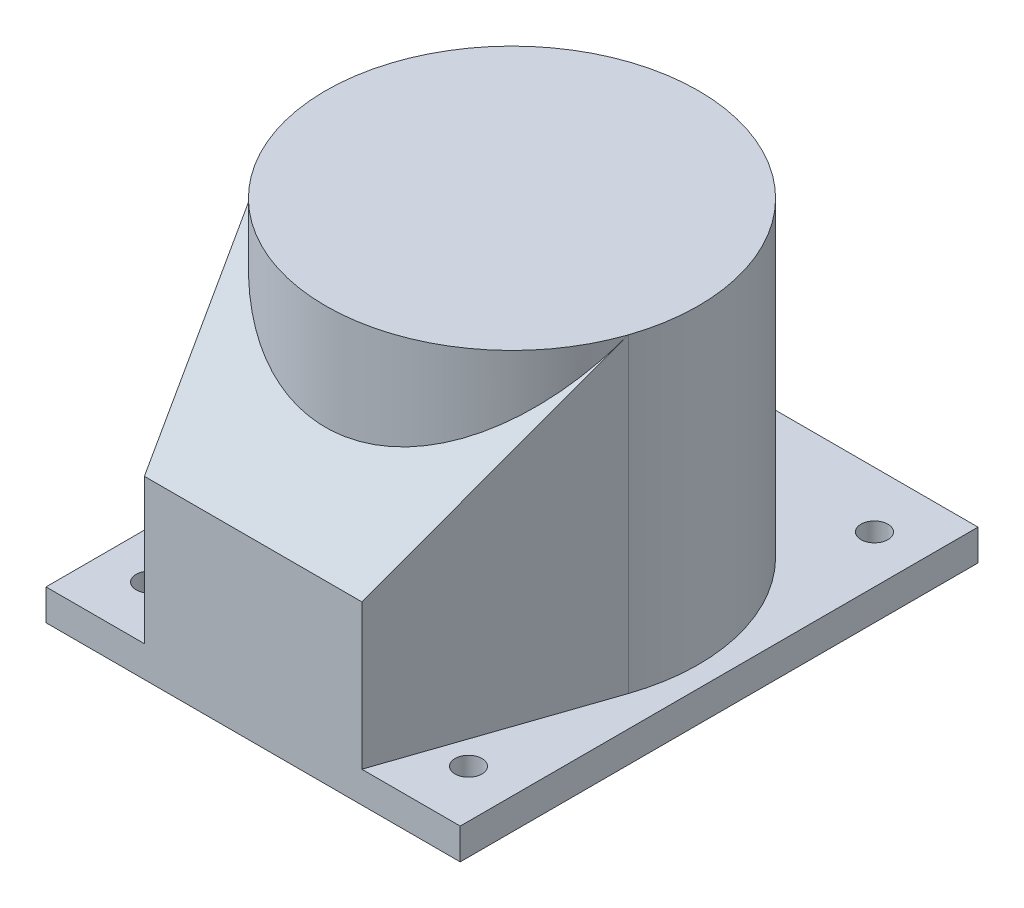
ISO-10303-21;
HEADER;
FILE_DESCRIPTION(('STEP AP214'),'2;1');
FILE_NAME('part.step','',(''),(''),'','','');
FILE_SCHEMA(('AUTOMOTIVE_DESIGN { 1 0 10303 214 1 1 1 1 }'));
ENDSEC;
DATA;
#1=APPLICATION_CONTEXT('core data for automotive mechanical design processes');
#2=APPLICATION_PROTOCOL_DEFINITION('international standard','automotive_design',2000,#1);
#3=PRODUCT_CONTEXT('',#1,'mechanical');
#4=PRODUCT('Part','Part','',(#3));
#5=PRODUCT_RELATED_PRODUCT_CATEGORY('part','',(#4));
#6=PRODUCT_DEFINITION_FORMATION('','',#4);
#7=PRODUCT_DEFINITION_CONTEXT('part definition',#1,'design');
#8=PRODUCT_DEFINITION('design','',#6,#7);
#9=PRODUCT_DEFINITION_SHAPE('','',#8);
#10=(LENGTH_UNIT() NAMED_UNIT(*) SI_UNIT(.MILLI.,.METRE.));
#11=(NAMED_UNIT(*) PLANE_ANGLE_UNIT() SI_UNIT($,.RADIAN.));
#12=(NAMED_UNIT(*) SI_UNIT($,.STERADIAN.) SOLID_ANGLE_UNIT());
#13=UNCERTAINTY_MEASURE_WITH_UNIT(LENGTH_MEASURE(1.E-05),#10,'distance_accuracy_value','');
#14=(GEOMETRIC_REPRESENTATION_CONTEXT(3) GLOBAL_UNCERTAINTY_ASSIGNED_CONTEXT((#13)) GLOBAL_UNIT_ASSIGNED_CONTEXT((#10,
#11,#12)) REPRESENTATION_CONTEXT('',''));
#15=CARTESIAN_POINT('',(0.,0.,0.));
#16=DIRECTION('',(0.,0.,1.));
#17=DIRECTION('',(1.,0.,0.));
#18=AXIS2_PLACEMENT_3D('',#15,#16,#17);
#19=CARTESIAN_POINT('',(99.9999999999996,15.,125.));
#20=DIRECTION('',(0.,0.,-1.));
#21=DIRECTION('',(-1.,0.,0.));
#22=AXIS2_PLACEMENT_3D('',#19,#20,#21);
#23=PLANE('',#22);
#24=DIRECTION('',(1.,0.,0.));
#25=VECTOR('',#24,1.);
#26=CARTESIAN_POINT('',(-515.841961586301,85.,124.999999999998));
#27=LINE('',#26,#25);
#28=CARTESIAN_POINT('',(-52.5000000000006,85.,125.));
#29=VERTEX_POINT('',#28);
#30=CARTESIAN_POINT('',(52.4999999999994,85.,125.));
#31=VERTEX_POINT('',#30);
#32=EDGE_CURVE('E106',#29,#31,#27,.T.);
#33=ORIENTED_EDGE('',*,*,#32,.F.);
#34=DIRECTION('',(0.,-1.,0.));
#35=VECTOR('',#34,1.);
#36=CARTESIAN_POINT('',(-52.5000000000004,165.,125.));
#37=LINE('',#36,#35);
#38=CARTESIAN_POINT('',(-52.5000000000004,15.,125.));
#39=VERTEX_POINT('',#38);
#40=EDGE_CURVE('E122',#29,#39,#37,.T.);
#41=ORIENTED_EDGE('',*,*,#40,.T.);
#42=DIRECTION('',(1.,0.,0.));
#43=VECTOR('',#42,1.);
#44=CARTESIAN_POINT('',(99.9999999999996,15.,125.));
#45=LINE('',#44,#43);
#46=CARTESIAN_POINT('',(-100.,15.,125.));
#47=VERTEX_POINT('',#46);
#48=EDGE_CURVE('E171',#47,#39,#45,.T.);
#49=ORIENTED_EDGE('',*,*,#48,.F.);
#50=DIRECTION('',(0.,-1.,0.));
#51=VECTOR('',#50,1.);
#52=CARTESIAN_POINT('',(-100.,15.,125.));
#53=LINE('',#52,#51);
#54=CARTESIAN_POINT('',(-100.,0.,125.));
#55=VERTEX_POINT('',#54);
#56=EDGE_CURVE('E40',#47,#55,#53,.T.);
#57=ORIENTED_EDGE('',*,*,#56,.T.);
#58=DIRECTION('',(1.,0.,0.));
#59=VECTOR('',#58,1.);
#60=CARTESIAN_POINT('',(99.9999999999996,0.,125.));
#61=LINE('',#60,#59);
#62=CARTESIAN_POINT('',(99.9999999999996,0.,125.));
#63=VERTEX_POINT('',#62);
#64=EDGE_CURVE('E180',#55,#63,#61,.T.);
#65=ORIENTED_EDGE('',*,*,#64,.T.);
#66=DIRECTION('',(0.,-1.,0.));
#67=VECTOR('',#66,1.);
#68=CARTESIAN_POINT('',(99.9999999999996,15.,125.));
#69=LINE('',#68,#67);
#70=CARTESIAN_POINT('',(99.9999999999996,15.,125.));
#71=VERTEX_POINT('',#70);
#72=EDGE_CURVE('E185',#71,#63,#69,.T.);
#73=ORIENTED_EDGE('',*,*,#72,.F.);
#74=CARTESIAN_POINT('',(52.4999999999996,15.,125.));
#75=VERTEX_POINT('',#74);
#76=EDGE_CURVE('E170',#75,#71,#45,.T.);
#77=ORIENTED_EDGE('',*,*,#76,.F.);
#78=DIRECTION('',(0.,-1.,0.));
#79=VECTOR('',#78,1.);
#80=CARTESIAN_POINT('',(52.4999999999996,165.,125.));
#81=LINE('',#80,#79);
#82=EDGE_CURVE('E55',#31,#75,#81,.T.);
#83=ORIENTED_EDGE('',*,*,#82,.F.);
#84=EDGE_LOOP('',(#33,#41,#49,#57,#65,#73,#77,#83));
#85=FACE_BOUND('',#84,.T.);
#86=ADVANCED_FACE('F32',(#85),#23,.F.);
#87=CARTESIAN_POINT('',(52.4999999999996,165.,125.));
#88=DIRECTION('',(-0.946592988462197,0.,-0.32243094484588));
#89=DIRECTION('',(-0.32243094484588,0.,0.946592988462197));
#90=AXIS2_PLACEMENT_3D('',#87,#88,#89);
#91=PLANE('',#90);
#92=DIRECTION('',(0.253131026430143,0.619406404344494,-0.743142240567341));
#93=VECTOR('',#92,1.);
#94=CARTESIAN_POINT('',(65.0432783127296,115.693143499438,88.175434948294));
#95=LINE('',#94,#93);
#96=CARTESIAN_POINT('',(85.1933689615977,165.,29.0187850361292));
#97=VERTEX_POINT('',#96);
#98=EDGE_CURVE('E113',#31,#97,#95,.T.);
#99=ORIENTED_EDGE('',*,*,#98,.F.);
#100=ORIENTED_EDGE('',*,*,#82,.T.);
#101=DIRECTION('',(0.32243094484588,0.,-0.946592988462197));
#102=VECTOR('',#101,1.);
#103=CARTESIAN_POINT('',(52.4999999999996,15.,125.));
#104=LINE('',#103,#102);
#105=CARTESIAN_POINT('',(85.1933689615977,15.,29.0187850361292));
#106=VERTEX_POINT('',#105);
#107=EDGE_CURVE('E209',#75,#106,#104,.T.);
#108=ORIENTED_EDGE('',*,*,#107,.T.);
#109=DIRECTION('',(0.,-1.,0.));
#110=VECTOR('',#109,1.);
#111=CARTESIAN_POINT('',(85.1933689615977,165.,29.0187850361292));
#112=LINE('',#111,#110);
#113=EDGE_CURVE('E132',#97,#106,#112,.T.);
#114=ORIENTED_EDGE('',*,*,#113,.F.);
#115=EDGE_LOOP('',(#99,#100,#108,#114));
#116=FACE_BOUND('',#115,.T.);
#117=ADVANCED_FACE('F214',(#116),#91,.F.);
#118=CARTESIAN_POINT('',(-52.5000000000004,165.,125.));
#119=DIRECTION('',(-0.946592988462199,0.,0.322430944845874));
#120=DIRECTION('',(0.322430944845874,0.,0.946592988462199));
#121=AXIS2_PLACEMENT_3D('',#118,#119,#120);
#122=PLANE('',#121);
#123=ORIENTED_EDGE('',*,*,#40,.F.);
#124=DIRECTION('',(-0.253131026430137,0.619406404344494,-0.743142240567343));
#125=VECTOR('',#124,1.);
#126=CARTESIAN_POINT('',(-65.0432783127302,115.693143499438,88.1754349482935));
#127=LINE('',#126,#125);
#128=CARTESIAN_POINT('',(-85.1933689615979,165.,29.0187850361286));
#129=VERTEX_POINT('',#128);
#130=EDGE_CURVE('E111',#29,#129,#127,.T.);
#131=ORIENTED_EDGE('',*,*,#130,.T.);
#132=DIRECTION('',(0.,-1.,0.));
#133=VECTOR('',#132,1.);
#134=CARTESIAN_POINT('',(-85.1933689615979,165.,29.0187850361287));
#135=LINE('',#134,#133);
#136=CARTESIAN_POINT('',(-85.1933689615979,15.,29.0187850361287));
#137=VERTEX_POINT('',#136);
#138=EDGE_CURVE('E120',#129,#137,#135,.T.);
#139=ORIENTED_EDGE('',*,*,#138,.T.);
#140=DIRECTION('',(-0.322430944845874,0.,-0.946592988462199));
#141=VECTOR('',#140,1.);
#142=CARTESIAN_POINT('',(-52.5000000000004,15.,125.));
#143=LINE('',#142,#141);
#144=EDGE_CURVE('E47',#39,#137,#143,.T.);
#145=ORIENTED_EDGE('',*,*,#144,.F.);
#146=EDGE_LOOP('',(#123,#131,#139,#145));
#147=FACE_BOUND('',#146,.T.);
#148=ADVANCED_FACE('F118',(#147),#122,.T.);
#149=CARTESIAN_POINT('',(0.,165.,0.));
#150=DIRECTION('',(0.,1.,0.));
#151=DIRECTION('',(-1.,0.,0.));
#152=AXIS2_PLACEMENT_3D('',#149,#150,#151);
#153=PLANE('',#152);
#154=CARTESIAN_POINT('',(0.,165.,0.));
#155=DIRECTION('',(0.,1.,0.));
#156=DIRECTION('',(-1.,0.,0.));
#157=AXIS2_PLACEMENT_3D('',#154,#155,#156);
#158=CIRCLE('',#157,90.);
#159=EDGE_CURVE('E125',#97,#129,#158,.T.);
#160=ORIENTED_EDGE('',*,*,#159,.T.);
#161=CARTESIAN_POINT('',(0.,165.,0.));
#162=DIRECTION('',(0.,1.,0.));
#163=DIRECTION('',(1.,0.,0.));
#164=AXIS2_PLACEMENT_3D('',#161,#162,#163);
#165=CIRCLE('',#164,90.);
#166=EDGE_CURVE('E99',#129,#97,#165,.T.);
#167=ORIENTED_EDGE('',*,*,#166,.T.);
#168=EDGE_LOOP('',(#160,#167));
#169=FACE_BOUND('',#168,.T.);
#170=ADVANCED_FACE('F126',(#169),#153,.T.);
#171=CARTESIAN_POINT('',(0.,15.,0.));
#172=DIRECTION('',(0.,-1.,0.));
#173=DIRECTION('',(1.,0.,0.));
#174=AXIS2_PLACEMENT_3D('',#171,#172,#173);
#175=PLANE('',#174);
#176=ORIENTED_EDGE('',*,*,#48,.T.);
#177=ORIENTED_EDGE('',*,*,#144,.T.);
#178=CARTESIAN_POINT('',(0.,15.,0.));
#179=DIRECTION('',(0.,1.,0.));
#180=DIRECTION('',(-1.,0.,0.));
#181=AXIS2_PLACEMENT_3D('',#178,#179,#180);
#182=CIRCLE('',#181,90.);
#183=EDGE_CURVE('E131',#106,#137,#182,.T.);
#184=ORIENTED_EDGE('',*,*,#183,.F.);
#185=ORIENTED_EDGE('',*,*,#107,.F.);
#186=ORIENTED_EDGE('',*,*,#76,.T.);
#187=DIRECTION('',(0.,0.,-1.));
#188=VECTOR('',#187,1.);
#189=CARTESIAN_POINT('',(99.9999999999996,15.,125.));
#190=LINE('',#189,#188);
#191=CARTESIAN_POINT('',(100.,15.,-125.));
#192=VERTEX_POINT('',#191);
#193=EDGE_CURVE('E173',#71,#192,#190,.T.);
#194=ORIENTED_EDGE('',*,*,#193,.T.);
#195=DIRECTION('',(-1.,0.,0.));
#196=VECTOR('',#195,1.);
#197=CARTESIAN_POINT('',(100.,15.,-125.));
#198=LINE('',#197,#196);
#199=CARTESIAN_POINT('',(-99.9999999999996,15.,-125.));
#200=VERTEX_POINT('',#199);
#201=EDGE_CURVE('E164',#192,#200,#198,.T.);
#202=ORIENTED_EDGE('',*,*,#201,.T.);
#203=DIRECTION('',(0.,0.,1.));
#204=VECTOR('',#203,1.);
#205=CARTESIAN_POINT('',(-100.,15.,125.));
#206=LINE('',#205,#204);
#207=EDGE_CURVE('E167',#200,#47,#206,.T.);
#208=ORIENTED_EDGE('',*,*,#207,.T.);
#209=EDGE_LOOP('',(#176,#177,#184,#185,#186,#194,#202,#208));
#210=FACE_BOUND('',#209,.T.);
#211=CARTESIAN_POINT('',(77.0000000000003,15.,-97.9999999999998));
#212=DIRECTION('',(0.,1.,0.));
#213=DIRECTION('',(-1.,0.,0.));
#214=AXIS2_PLACEMENT_3D('',#211,#212,#213);
#215=CIRCLE('',#214,6.5);
#216=CARTESIAN_POINT('',(70.5000000000003,15.,-97.9999999999998));
#217=VERTEX_POINT('',#216);
#218=EDGE_CURVE('E158',#217,#217,#215,.T.);
#219=ORIENTED_EDGE('',*,*,#218,.F.);
#220=EDGE_LOOP('',(#219));
#221=FACE_BOUND('',#220,.T.);
#222=CARTESIAN_POINT('',(76.9999999999996,15.,98.0000000000003));
#223=DIRECTION('',(0.,1.,0.));
#224=DIRECTION('',(1.,0.,0.));
#225=AXIS2_PLACEMENT_3D('',#222,#223,#224);
#226=CIRCLE('',#225,6.5);
#227=CARTESIAN_POINT('',(83.4999999999996,15.,98.0000000000003));
#228=VERTEX_POINT('',#227);
#229=EDGE_CURVE('E152',#228,#228,#226,.T.);
#230=ORIENTED_EDGE('',*,*,#229,.F.);
#231=EDGE_LOOP('',(#230));
#232=FACE_BOUND('',#231,.T.);
#233=CARTESIAN_POINT('',(-76.9999999999997,15.,-98.0000000000003));
#234=DIRECTION('',(0.,1.,0.));
#235=DIRECTION('',(1.,0.,0.));
#236=AXIS2_PLACEMENT_3D('',#233,#234,#235);
#237=CIRCLE('',#236,6.5);
#238=CARTESIAN_POINT('',(-70.4999999999997,15.,-98.0000000000003));
#239=VERTEX_POINT('',#238);
#240=EDGE_CURVE('E146',#239,#239,#237,.T.);
#241=ORIENTED_EDGE('',*,*,#240,.F.);
#242=EDGE_LOOP('',(#241));
#243=FACE_BOUND('',#242,.T.);
#244=CARTESIAN_POINT('',(-77.0000000000004,15.,97.9999999999998));
#245=DIRECTION('',(0.,1.,0.));
#246=DIRECTION('',(-1.,0.,0.));
#247=AXIS2_PLACEMENT_3D('',#244,#245,#246);
#248=CIRCLE('',#247,6.5);
#249=CARTESIAN_POINT('',(-83.5000000000004,15.,97.9999999999997));
#250=VERTEX_POINT('',#249);
#251=EDGE_CURVE('E140',#250,#250,#248,.T.);
#252=ORIENTED_EDGE('',*,*,#251,.F.);
#253=EDGE_LOOP('',(#252));
#254=FACE_BOUND('',#253,.T.);
#255=ADVANCED_FACE('F206',(#210,#221,#232,#243,#254),#175,.F.);
#256=CARTESIAN_POINT('',(0.,0.,0.));
#257=DIRECTION('',(0.,-1.,0.));
#258=DIRECTION('',(1.,0.,0.));
#259=AXIS2_PLACEMENT_3D('',#256,#257,#258);
#260=PLANE('',#259);
#261=CARTESIAN_POINT('',(-76.9999999999997,0.,-98.0000000000003));
#262=DIRECTION('',(0.,1.,0.));
#263=DIRECTION('',(1.,0.,0.));
#264=AXIS2_PLACEMENT_3D('',#261,#262,#263);
#265=CIRCLE('',#264,6.5);
#266=CARTESIAN_POINT('',(-70.4999999999997,0.,-98.0000000000003));
#267=VERTEX_POINT('',#266);
#268=EDGE_CURVE('E143',#267,#267,#265,.T.);
#269=ORIENTED_EDGE('',*,*,#268,.T.);
#270=EDGE_LOOP('',(#269));
#271=FACE_BOUND('',#270,.T.);
#272=CARTESIAN_POINT('',(77.0000000000003,0.,-97.9999999999998));
#273=DIRECTION('',(0.,1.,0.));
#274=DIRECTION('',(-1.,0.,0.));
#275=AXIS2_PLACEMENT_3D('',#272,#273,#274);
#276=CIRCLE('',#275,6.5);
#277=CARTESIAN_POINT('',(70.5000000000003,0.,-97.9999999999998));
#278=VERTEX_POINT('',#277);
#279=EDGE_CURVE('E155',#278,#278,#276,.T.);
#280=ORIENTED_EDGE('',*,*,#279,.T.);
#281=EDGE_LOOP('',(#280));
#282=FACE_BOUND('',#281,.T.);
#283=DIRECTION('',(-1.,0.,0.));
#284=VECTOR('',#283,1.);
#285=CARTESIAN_POINT('',(100.,0.,-125.));
#286=LINE('',#285,#284);
#287=CARTESIAN_POINT('',(100.,0.,-125.));
#288=VERTEX_POINT('',#287);
#289=CARTESIAN_POINT('',(-99.9999999999996,0.,-125.));
#290=VERTEX_POINT('',#289);
#291=EDGE_CURVE('E161',#288,#290,#286,.T.);
#292=ORIENTED_EDGE('',*,*,#291,.F.);
#293=DIRECTION('',(0.,0.,-1.));
#294=VECTOR('',#293,1.);
#295=CARTESIAN_POINT('',(99.9999999999996,0.,125.));
#296=LINE('',#295,#294);
#297=EDGE_CURVE('E168',#63,#288,#296,.T.);
#298=ORIENTED_EDGE('',*,*,#297,.F.);
#299=ORIENTED_EDGE('',*,*,#64,.F.);
#300=DIRECTION('',(0.,0.,1.));
#301=VECTOR('',#300,1.);
#302=CARTESIAN_POINT('',(-100.,0.,125.));
#303=LINE('',#302,#301);
#304=EDGE_CURVE('E178',#290,#55,#303,.T.);
#305=ORIENTED_EDGE('',*,*,#304,.F.);
#306=EDGE_LOOP('',(#292,#298,#299,#305));
#307=FACE_BOUND('',#306,.T.);
#308=CARTESIAN_POINT('',(76.9999999999996,0.,98.0000000000003));
#309=DIRECTION('',(0.,1.,0.));
#310=DIRECTION('',(1.,0.,0.));
#311=AXIS2_PLACEMENT_3D('',#308,#309,#310);
#312=CIRCLE('',#311,6.5);
#313=CARTESIAN_POINT('',(83.4999999999996,0.,98.0000000000003));
#314=VERTEX_POINT('',#313);
#315=EDGE_CURVE('E149',#314,#314,#312,.T.);
#316=ORIENTED_EDGE('',*,*,#315,.T.);
#317=EDGE_LOOP('',(#316));
#318=FACE_BOUND('',#317,.T.);
#319=CARTESIAN_POINT('',(-77.0000000000004,0.,97.9999999999998));
#320=DIRECTION('',(0.,1.,0.));
#321=DIRECTION('',(-1.,0.,0.));
#322=AXIS2_PLACEMENT_3D('',#319,#320,#321);
#323=CIRCLE('',#322,6.5);
#324=CARTESIAN_POINT('',(-83.5000000000004,0.,97.9999999999997));
#325=VERTEX_POINT('',#324);
#326=EDGE_CURVE('E139',#325,#325,#323,.T.);
#327=ORIENTED_EDGE('',*,*,#326,.T.);
#328=EDGE_LOOP('',(#327));
#329=FACE_BOUND('',#328,.T.);
#330=ADVANCED_FACE('F197',(#271,#282,#307,#318,#329),#260,.T.);
#331=CARTESIAN_POINT('',(100.,15.,-125.));
#332=DIRECTION('',(0.,0.,1.));
#333=DIRECTION('',(1.,0.,0.));
#334=AXIS2_PLACEMENT_3D('',#331,#332,#333);
#335=PLANE('',#334);
#336=ORIENTED_EDGE('',*,*,#291,.T.);
#337=DIRECTION('',(0.,-1.,0.));
#338=VECTOR('',#337,1.);
#339=CARTESIAN_POINT('',(-99.9999999999996,15.,-125.));
#340=LINE('',#339,#338);
#341=EDGE_CURVE('E11',#200,#290,#340,.T.);
#342=ORIENTED_EDGE('',*,*,#341,.F.);
#343=ORIENTED_EDGE('',*,*,#201,.F.);
#344=DIRECTION('',(0.,-1.,0.));
#345=VECTOR('',#344,1.);
#346=CARTESIAN_POINT('',(100.,15.,-125.));
#347=LINE('',#346,#345);
#348=EDGE_CURVE('E175',#192,#288,#347,.T.);
#349=ORIENTED_EDGE('',*,*,#348,.T.);
#350=EDGE_LOOP('',(#336,#342,#343,#349));
#351=FACE_BOUND('',#350,.T.);
#352=ADVANCED_FACE('F34',(#351),#335,.F.);
#353=CARTESIAN_POINT('',(-100.,15.,125.));
#354=DIRECTION('',(1.,0.,0.));
#355=DIRECTION('',(0.,0.,-1.));
#356=AXIS2_PLACEMENT_3D('',#353,#354,#355);
#357=PLANE('',#356);
#358=ORIENTED_EDGE('',*,*,#304,.T.);
#359=ORIENTED_EDGE('',*,*,#56,.F.);
#360=ORIENTED_EDGE('',*,*,#207,.F.);
#361=ORIENTED_EDGE('',*,*,#341,.T.);
#362=EDGE_LOOP('',(#358,#359,#360,#361));
#363=FACE_BOUND('',#362,.T.);
#364=ADVANCED_FACE('F247',(#363),#357,.F.);
#365=CARTESIAN_POINT('',(99.9999999999996,15.,125.));
#366=DIRECTION('',(-1.,0.,0.));
#367=DIRECTION('',(0.,0.,1.));
#368=AXIS2_PLACEMENT_3D('',#365,#366,#367);
#369=PLANE('',#368);
#370=ORIENTED_EDGE('',*,*,#297,.T.);
#371=ORIENTED_EDGE('',*,*,#348,.F.);
#372=ORIENTED_EDGE('',*,*,#193,.F.);
#373=ORIENTED_EDGE('',*,*,#72,.T.);
#374=EDGE_LOOP('',(#370,#371,#372,#373));
#375=FACE_BOUND('',#374,.T.);
#376=ADVANCED_FACE('F201',(#375),#369,.F.);
#377=CARTESIAN_POINT('',(77.0000000000003,15.,-97.9999999999998));
#378=DIRECTION('',(0.,-1.,0.));
#379=DIRECTION('',(1.,0.,0.));
#380=AXIS2_PLACEMENT_3D('',#377,#378,#379);
#381=CYLINDRICAL_SURFACE('',#380,6.5);
#382=ORIENTED_EDGE('',*,*,#218,.T.);
#383=EDGE_LOOP('',(#382));
#384=FACE_BOUND('',#383,.T.);
#385=ORIENTED_EDGE('',*,*,#279,.F.);
#386=EDGE_LOOP('',(#385));
#387=FACE_BOUND('',#386,.T.);
#388=ADVANCED_FACE('F236',(#384,#387),#381,.F.);
#389=CARTESIAN_POINT('',(76.9999999999996,15.,98.0000000000003));
#390=DIRECTION('',(0.,-1.,0.));
#391=DIRECTION('',(1.,0.,0.));
#392=AXIS2_PLACEMENT_3D('',#389,#390,#391);
#393=CYLINDRICAL_SURFACE('',#392,6.5);
#394=ORIENTED_EDGE('',*,*,#229,.T.);
#395=EDGE_LOOP('',(#394));
#396=FACE_BOUND('',#395,.T.);
#397=ORIENTED_EDGE('',*,*,#315,.F.);
#398=EDGE_LOOP('',(#397));
#399=FACE_BOUND('',#398,.T.);
#400=ADVANCED_FACE('F232',(#396,#399),#393,.F.);
#401=CARTESIAN_POINT('',(-76.9999999999997,15.,-98.0000000000003));
#402=DIRECTION('',(0.,-1.,0.));
#403=DIRECTION('',(1.,0.,0.));
#404=AXIS2_PLACEMENT_3D('',#401,#402,#403);
#405=CYLINDRICAL_SURFACE('',#404,6.5);
#406=ORIENTED_EDGE('',*,*,#240,.T.);
#407=EDGE_LOOP('',(#406));
#408=FACE_BOUND('',#407,.T.);
#409=ORIENTED_EDGE('',*,*,#268,.F.);
#410=EDGE_LOOP('',(#409));
#411=FACE_BOUND('',#410,.T.);
#412=ADVANCED_FACE('F228',(#408,#411),#405,.F.);
#413=CARTESIAN_POINT('',(-77.0000000000004,15.,97.9999999999998));
#414=DIRECTION('',(0.,-1.,0.));
#415=DIRECTION('',(1.,0.,0.));
#416=AXIS2_PLACEMENT_3D('',#413,#414,#415);
#417=CYLINDRICAL_SURFACE('',#416,6.5);
#418=ORIENTED_EDGE('',*,*,#251,.T.);
#419=EDGE_LOOP('',(#418));
#420=FACE_BOUND('',#419,.T.);
#421=ORIENTED_EDGE('',*,*,#326,.F.);
#422=EDGE_LOOP('',(#421));
#423=FACE_BOUND('',#422,.T.);
#424=ADVANCED_FACE('F225',(#420,#423),#417,.F.);
#425=CARTESIAN_POINT('',(0.,165.,0.));
#426=DIRECTION('',(0.,-1.,0.));
#427=DIRECTION('',(1.,0.,0.));
#428=AXIS2_PLACEMENT_3D('',#425,#426,#427);
#429=CYLINDRICAL_SURFACE('',#428,90.);
#430=ORIENTED_EDGE('',*,*,#183,.T.);
#431=ORIENTED_EDGE('',*,*,#138,.F.);
#432=ORIENTED_EDGE('',*,*,#159,.F.);
#433=ORIENTED_EDGE('',*,*,#113,.T.);
#434=EDGE_LOOP('',(#430,#431,#432,#433));
#435=FACE_BOUND('',#434,.T.);
#436=ADVANCED_FACE('F130',(#435),#429,.T.);
#437=CARTESIAN_POINT('',(-515.8419615863,165.,29.0187850361272));
#438=DIRECTION('',(0.,0.768159660896053,0.640258334871215));
#439=DIRECTION('',(0.,0.640258334871215,-0.768159660896053));
#440=AXIS2_PLACEMENT_3D('',#437,#438,#439);
#441=PLANE('',#440);
#442=CARTESIAN_POINT('',(0.,189.187053724709,0.));
#443=DIRECTION('',(0.,0.768159660896053,0.640258334871215));
#444=DIRECTION('',(0.,0.640258334871215,-0.768159660896053));
#445=AXIS2_PLACEMENT_3D('',#442,#443,#444);
#446=ELLIPSE('',#445,117.16314274433,90.);
#447=EDGE_CURVE('E102',#97,#129,#446,.F.);
#448=ORIENTED_EDGE('',*,*,#447,.T.);
#449=ORIENTED_EDGE('',*,*,#130,.F.);
#450=ORIENTED_EDGE('',*,*,#32,.T.);
#451=ORIENTED_EDGE('',*,*,#98,.T.);
#452=EDGE_LOOP('',(#448,#449,#450,#451));
#453=FACE_BOUND('',#452,.T.);
#454=ADVANCED_FACE('F110',(#453),#441,.T.);
#455=CARTESIAN_POINT('',(0.,-500000.,0.));
#456=DIRECTION('',(0.,1.,0.));
#457=DIRECTION('',(-1.,0.,0.));
#458=AXIS2_PLACEMENT_3D('',#455,#456,#457);
#459=CYLINDRICAL_SURFACE('',#458,90.);
#460=ORIENTED_EDGE('',*,*,#447,.F.);
#461=ORIENTED_EDGE('',*,*,#166,.F.);
#462=EDGE_LOOP('',(#460,#461));
#463=FACE_BOUND('',#462,.T.);
#464=ADVANCED_FACE('F101',(#463),#459,.T.);
#465=CLOSED_SHELL('',(#86,#117,#148,#170,#255,#330,#352,#364,#376,#388,#400,#412,#424,#436,#454,#464));
#466=MANIFOLD_SOLID_BREP('B2',#465);
#467=ADVANCED_BREP_SHAPE_REPRESENTATION('',(#18,#466),#14);
#468=SHAPE_DEFINITION_REPRESENTATION(#9,#467);
ENDSEC;
END-ISO-10303-21;
